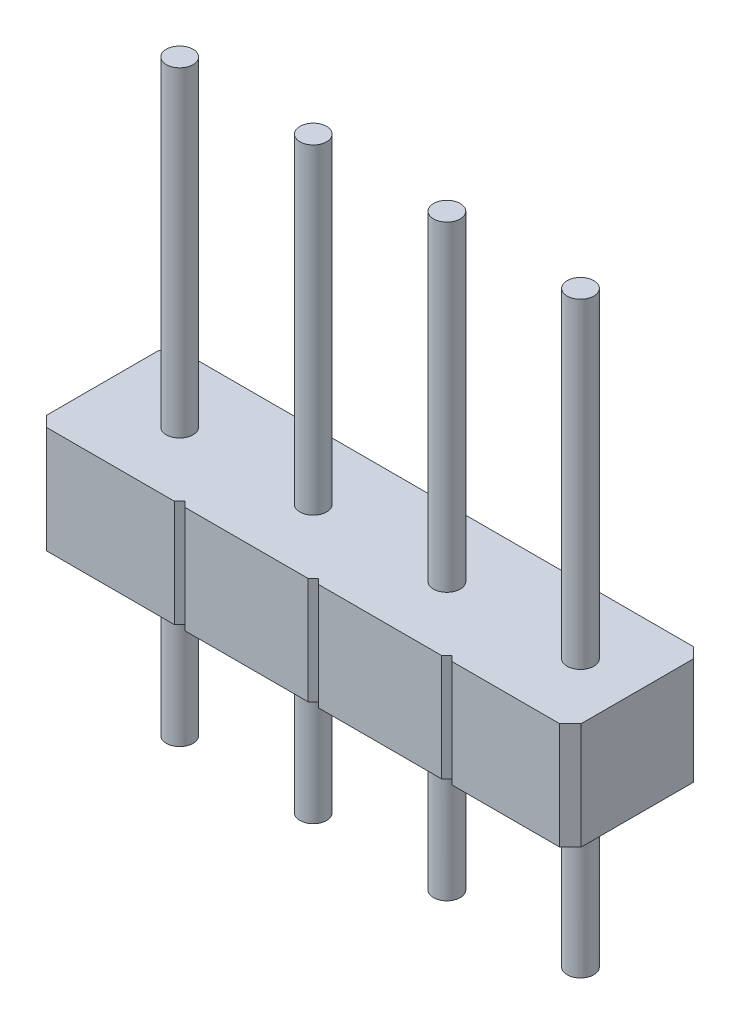
ISO-10303-21;
HEADER;
FILE_DESCRIPTION(('STEP AP214'),'2;1');
FILE_NAME('part.step','',(''),(''),'','','');
FILE_SCHEMA(('AUTOMOTIVE_DESIGN { 1 0 10303 214 1 1 1 1 }'));
ENDSEC;
DATA;
#1=APPLICATION_CONTEXT('core data for automotive mechanical design processes');
#2=APPLICATION_PROTOCOL_DEFINITION('international standard','automotive_design',2000,#1);
#3=PRODUCT_CONTEXT('',#1,'mechanical');
#4=PRODUCT('Part','Part','',(#3));
#5=PRODUCT_RELATED_PRODUCT_CATEGORY('part','',(#4));
#6=PRODUCT_DEFINITION_FORMATION('','',#4);
#7=PRODUCT_DEFINITION_CONTEXT('part definition',#1,'design');
#8=PRODUCT_DEFINITION('design','',#6,#7);
#9=PRODUCT_DEFINITION_SHAPE('','',#8);
#10=(LENGTH_UNIT() NAMED_UNIT(*) SI_UNIT(.MILLI.,.METRE.));
#11=(NAMED_UNIT(*) PLANE_ANGLE_UNIT() SI_UNIT($,.RADIAN.));
#12=(NAMED_UNIT(*) SI_UNIT($,.STERADIAN.) SOLID_ANGLE_UNIT());
#13=UNCERTAINTY_MEASURE_WITH_UNIT(LENGTH_MEASURE(1.E-05),#10,'distance_accuracy_value','');
#14=(GEOMETRIC_REPRESENTATION_CONTEXT(3) GLOBAL_UNCERTAINTY_ASSIGNED_CONTEXT((#13)) GLOBAL_UNIT_ASSIGNED_CONTEXT((#10,
#11,#12)) REPRESENTATION_CONTEXT('',''));
#15=CARTESIAN_POINT('',(0.,0.,0.));
#16=DIRECTION('',(0.,0.,1.));
#17=DIRECTION('',(1.,0.,0.));
#18=AXIS2_PLACEMENT_3D('',#15,#16,#17);
#19=CARTESIAN_POINT('',(0.,2.,0.));
#20=DIRECTION('',(0.,-1.,0.));
#21=DIRECTION('',(0.,0.,-1.));
#22=AXIS2_PLACEMENT_3D('',#19,#20,#21);
#23=PLANE('',#22);
#24=DIRECTION('',(-0.707106781186547,0.,0.707106781186548));
#25=VECTOR('',#24,1.);
#26=CARTESIAN_POINT('',(-5.,2.,-1.05));
#27=LINE('',#26,#25);
#28=CARTESIAN_POINT('',(-4.8,2.,-1.25));
#29=VERTEX_POINT('',#28);
#30=CARTESIAN_POINT('',(-5.,2.,-1.05));
#31=VERTEX_POINT('',#30);
#32=EDGE_CURVE('E291',#29,#31,#27,.T.);
#33=ORIENTED_EDGE('',*,*,#32,.T.);
#34=DIRECTION('',(0.,0.,1.));
#35=VECTOR('',#34,1.);
#36=CARTESIAN_POINT('',(-5.,2.,-1.05));
#37=LINE('',#36,#35);
#38=CARTESIAN_POINT('',(-5.,2.,1.05));
#39=VERTEX_POINT('',#38);
#40=EDGE_CURVE('E149',#31,#39,#37,.T.);
#41=ORIENTED_EDGE('',*,*,#40,.T.);
#42=DIRECTION('',(0.707106781186547,0.,0.707106781186548));
#43=VECTOR('',#42,1.);
#44=CARTESIAN_POINT('',(-5.,2.,1.05));
#45=LINE('',#44,#43);
#46=CARTESIAN_POINT('',(-4.8,2.,1.25));
#47=VERTEX_POINT('',#46);
#48=EDGE_CURVE('E360',#39,#47,#45,.T.);
#49=ORIENTED_EDGE('',*,*,#48,.T.);
#50=DIRECTION('',(1.,0.,0.));
#51=VECTOR('',#50,1.);
#52=CARTESIAN_POINT('',(-4.8,2.,1.25));
#53=LINE('',#52,#51);
#54=CARTESIAN_POINT('',(-2.41138997367375,2.,1.25));
#55=VERTEX_POINT('',#54);
#56=EDGE_CURVE('E379',#47,#55,#53,.T.);
#57=ORIENTED_EDGE('',*,*,#56,.T.);
#58=DIRECTION('',(0.707106781186545,0.,-0.70710678118655));
#59=VECTOR('',#58,1.);
#60=CARTESIAN_POINT('',(-2.41138997367375,2.,1.25));
#61=LINE('',#60,#59);
#62=CARTESIAN_POINT('',(-2.31138997367375,2.,1.15));
#63=VERTEX_POINT('',#62);
#64=EDGE_CURVE('E376',#55,#63,#61,.T.);
#65=ORIENTED_EDGE('',*,*,#64,.T.);
#66=DIRECTION('',(0.707106781186548,0.,0.707106781186547));
#67=VECTOR('',#66,1.);
#68=CARTESIAN_POINT('',(-2.31138997367375,2.,1.15));
#69=LINE('',#68,#67);
#70=CARTESIAN_POINT('',(-2.21138997367375,2.,1.25));
#71=VERTEX_POINT('',#70);
#72=EDGE_CURVE('E378',#63,#71,#69,.T.);
#73=ORIENTED_EDGE('',*,*,#72,.T.);
#74=DIRECTION('',(1.,0.,0.));
#75=VECTOR('',#74,1.);
#76=CARTESIAN_POINT('',(-2.21138997367375,2.,1.25));
#77=LINE('',#76,#75);
#78=CARTESIAN_POINT('',(0.0886100263262443,2.,1.25));
#79=VERTEX_POINT('',#78);
#80=EDGE_CURVE('E381',#71,#79,#77,.T.);
#81=ORIENTED_EDGE('',*,*,#80,.T.);
#82=DIRECTION('',(0.707106781186546,0.,-0.707106781186549));
#83=VECTOR('',#82,1.);
#84=CARTESIAN_POINT('',(0.0886100263262443,2.,1.25));
#85=LINE('',#84,#83);
#86=CARTESIAN_POINT('',(0.188610026326244,2.,1.15));
#87=VERTEX_POINT('',#86);
#88=EDGE_CURVE('E387',#79,#87,#85,.T.);
#89=ORIENTED_EDGE('',*,*,#88,.T.);
#90=DIRECTION('',(0.707106781186549,0.,0.707106781186546));
#91=VECTOR('',#90,1.);
#92=CARTESIAN_POINT('',(0.188610026326244,2.,1.15));
#93=LINE('',#92,#91);
#94=CARTESIAN_POINT('',(0.288610026326245,2.,1.25));
#95=VERTEX_POINT('',#94);
#96=EDGE_CURVE('E389',#87,#95,#93,.T.);
#97=ORIENTED_EDGE('',*,*,#96,.T.);
#98=DIRECTION('',(1.,0.,0.));
#99=VECTOR('',#98,1.);
#100=CARTESIAN_POINT('',(0.288610026326245,2.,1.25));
#101=LINE('',#100,#99);
#102=CARTESIAN_POINT('',(2.58861002632625,2.,1.25));
#103=VERTEX_POINT('',#102);
#104=EDGE_CURVE('E391',#95,#103,#101,.T.);
#105=ORIENTED_EDGE('',*,*,#104,.T.);
#106=DIRECTION('',(0.707106781186546,0.,-0.707106781186549));
#107=VECTOR('',#106,1.);
#108=CARTESIAN_POINT('',(2.58861002632625,2.,1.25));
#109=LINE('',#108,#107);
#110=CARTESIAN_POINT('',(2.68861002632624,2.,1.15));
#111=VERTEX_POINT('',#110);
#112=EDGE_CURVE('E393',#103,#111,#109,.T.);
#113=ORIENTED_EDGE('',*,*,#112,.T.);
#114=DIRECTION('',(0.707106781186549,0.,0.707106781186546));
#115=VECTOR('',#114,1.);
#116=CARTESIAN_POINT('',(2.68861002632624,2.,1.15));
#117=LINE('',#116,#115);
#118=CARTESIAN_POINT('',(2.78861002632624,2.,1.25));
#119=VERTEX_POINT('',#118);
#120=EDGE_CURVE('E395',#111,#119,#117,.T.);
#121=ORIENTED_EDGE('',*,*,#120,.T.);
#122=DIRECTION('',(1.,0.,0.));
#123=VECTOR('',#122,1.);
#124=CARTESIAN_POINT('',(2.78861002632624,2.,1.25));
#125=LINE('',#124,#123);
#126=CARTESIAN_POINT('',(4.8,2.,1.25));
#127=VERTEX_POINT('',#126);
#128=EDGE_CURVE('E397',#119,#127,#125,.T.);
#129=ORIENTED_EDGE('',*,*,#128,.T.);
#130=DIRECTION('',(0.707106781186547,0.,-0.707106781186548));
#131=VECTOR('',#130,1.);
#132=CARTESIAN_POINT('',(4.8,2.,1.25));
#133=LINE('',#132,#131);
#134=CARTESIAN_POINT('',(5.,2.,1.05));
#135=VERTEX_POINT('',#134);
#136=EDGE_CURVE('E399',#127,#135,#133,.T.);
#137=ORIENTED_EDGE('',*,*,#136,.T.);
#138=DIRECTION('',(0.,0.,-1.));
#139=VECTOR('',#138,1.);
#140=CARTESIAN_POINT('',(5.,2.,-1.05));
#141=LINE('',#140,#139);
#142=CARTESIAN_POINT('',(5.,2.,-1.05));
#143=VERTEX_POINT('',#142);
#144=EDGE_CURVE('E401',#135,#143,#141,.T.);
#145=ORIENTED_EDGE('',*,*,#144,.T.);
#146=DIRECTION('',(-0.707106781186547,0.,-0.707106781186548));
#147=VECTOR('',#146,1.);
#148=CARTESIAN_POINT('',(4.8,2.,-1.25));
#149=LINE('',#148,#147);
#150=CARTESIAN_POINT('',(4.8,2.,-1.25));
#151=VERTEX_POINT('',#150);
#152=EDGE_CURVE('E403',#143,#151,#149,.T.);
#153=ORIENTED_EDGE('',*,*,#152,.T.);
#154=DIRECTION('',(-1.,0.,0.));
#155=VECTOR('',#154,1.);
#156=CARTESIAN_POINT('',(2.78861002632624,2.,-1.25));
#157=LINE('',#156,#155);
#158=CARTESIAN_POINT('',(2.78861002632624,2.,-1.25));
#159=VERTEX_POINT('',#158);
#160=EDGE_CURVE('E405',#151,#159,#157,.T.);
#161=ORIENTED_EDGE('',*,*,#160,.T.);
#162=DIRECTION('',(-0.707106781186547,0.,0.707106781186548));
#163=VECTOR('',#162,1.);
#164=CARTESIAN_POINT('',(2.68861002632624,2.,-1.15));
#165=LINE('',#164,#163);
#166=CARTESIAN_POINT('',(2.68861002632624,2.,-1.15));
#167=VERTEX_POINT('',#166);
#168=EDGE_CURVE('E407',#159,#167,#165,.T.);
#169=ORIENTED_EDGE('',*,*,#168,.T.);
#170=DIRECTION('',(-0.707106781186547,0.,-0.707106781186548));
#171=VECTOR('',#170,1.);
#172=CARTESIAN_POINT('',(2.58861002632624,2.,-1.25));
#173=LINE('',#172,#171);
#174=CARTESIAN_POINT('',(2.58861002632624,2.,-1.25));
#175=VERTEX_POINT('',#174);
#176=EDGE_CURVE('E409',#167,#175,#173,.T.);
#177=ORIENTED_EDGE('',*,*,#176,.T.);
#178=DIRECTION('',(-1.,0.,0.));
#179=VECTOR('',#178,1.);
#180=CARTESIAN_POINT('',(0.288610026326243,2.,-1.25));
#181=LINE('',#180,#179);
#182=CARTESIAN_POINT('',(0.288610026326243,2.,-1.25));
#183=VERTEX_POINT('',#182);
#184=EDGE_CURVE('E411',#175,#183,#181,.T.);
#185=ORIENTED_EDGE('',*,*,#184,.T.);
#186=DIRECTION('',(-0.707106781186547,0.,0.707106781186549));
#187=VECTOR('',#186,1.);
#188=CARTESIAN_POINT('',(0.188610026326244,2.,-1.15));
#189=LINE('',#188,#187);
#190=CARTESIAN_POINT('',(0.188610026326244,2.,-1.15));
#191=VERTEX_POINT('',#190);
#192=EDGE_CURVE('E413',#183,#191,#189,.T.);
#193=ORIENTED_EDGE('',*,*,#192,.T.);
#194=DIRECTION('',(-0.707106781186549,0.,-0.707106781186546));
#195=VECTOR('',#194,1.);
#196=CARTESIAN_POINT('',(0.0886100263262439,2.,-1.25));
#197=LINE('',#196,#195);
#198=CARTESIAN_POINT('',(0.0886100263262439,2.,-1.25));
#199=VERTEX_POINT('',#198);
#200=EDGE_CURVE('E415',#191,#199,#197,.T.);
#201=ORIENTED_EDGE('',*,*,#200,.T.);
#202=DIRECTION('',(-1.,0.,0.));
#203=VECTOR('',#202,1.);
#204=CARTESIAN_POINT('',(-2.2107197566744,2.,-1.25));
#205=LINE('',#204,#203);
#206=CARTESIAN_POINT('',(-2.2107197566744,2.,-1.25));
#207=VERTEX_POINT('',#206);
#208=EDGE_CURVE('E222',#199,#207,#205,.T.);
#209=ORIENTED_EDGE('',*,*,#208,.T.);
#210=DIRECTION('',(-0.619239922198396,0.,0.785201833133191));
#211=VECTOR('',#210,1.);
#212=CARTESIAN_POINT('',(-2.31138997367376,2.,-1.12234925253336));
#213=LINE('',#212,#211);
#214=CARTESIAN_POINT('',(-2.31138997367376,2.,-1.12234925253336));
#215=VERTEX_POINT('',#214);
#216=EDGE_CURVE('E216',#207,#215,#213,.T.);
#217=ORIENTED_EDGE('',*,*,#216,.T.);
#218=DIRECTION('',(-0.619239922198393,0.,-0.785201833133194));
#219=VECTOR('',#218,1.);
#220=CARTESIAN_POINT('',(-2.41206019067311,2.,-1.25));
#221=LINE('',#220,#219);
#222=CARTESIAN_POINT('',(-2.41206019067311,2.,-1.25));
#223=VERTEX_POINT('',#222);
#224=EDGE_CURVE('E220',#215,#223,#221,.T.);
#225=ORIENTED_EDGE('',*,*,#224,.T.);
#226=DIRECTION('',(-1.,0.,0.));
#227=VECTOR('',#226,1.);
#228=CARTESIAN_POINT('',(-4.8,2.,-1.25));
#229=LINE('',#228,#227);
#230=EDGE_CURVE('E52',#223,#29,#229,.T.);
#231=ORIENTED_EDGE('',*,*,#230,.T.);
#232=EDGE_LOOP('',(#33,#41,#49,#57,#65,#73,#81,#89,#97,#105,#113,#121,#129,#137,#145,#153,#161,
#169,#177,#185,#193,#201,#209,#217,#225,#231));
#233=FACE_BOUND('',#232,.T.);
#234=CARTESIAN_POINT('',(-3.56138997367376,2.,0.));
#235=DIRECTION('',(0.,1.,0.));
#236=DIRECTION('',(0.,0.,1.));
#237=AXIS2_PLACEMENT_3D('',#234,#235,#236);
#238=CIRCLE('',#237,0.25);
#239=CARTESIAN_POINT('',(-3.56138997367376,2.,0.25));
#240=VERTEX_POINT('',#239);
#241=EDGE_CURVE('E244',#240,#240,#238,.T.);
#242=ORIENTED_EDGE('',*,*,#241,.F.);
#243=EDGE_LOOP('',(#242));
#244=FACE_BOUND('',#243,.T.);
#245=CARTESIAN_POINT('',(-1.06138997367376,2.,0.));
#246=DIRECTION('',(0.,1.,0.));
#247=DIRECTION('',(0.,0.,1.));
#248=AXIS2_PLACEMENT_3D('',#245,#246,#247);
#249=CIRCLE('',#248,0.25);
#250=CARTESIAN_POINT('',(-1.06138997367376,2.,0.25));
#251=VERTEX_POINT('',#250);
#252=EDGE_CURVE('E543',#251,#251,#249,.T.);
#253=ORIENTED_EDGE('',*,*,#252,.F.);
#254=EDGE_LOOP('',(#253));
#255=FACE_BOUND('',#254,.T.);
#256=CARTESIAN_POINT('',(1.43861002632624,2.,0.));
#257=DIRECTION('',(0.,1.,0.));
#258=DIRECTION('',(0.,0.,1.));
#259=AXIS2_PLACEMENT_3D('',#256,#257,#258);
#260=CIRCLE('',#259,0.25);
#261=CARTESIAN_POINT('',(1.43861002632624,2.,0.25));
#262=VERTEX_POINT('',#261);
#263=EDGE_CURVE('E540',#262,#262,#260,.T.);
#264=ORIENTED_EDGE('',*,*,#263,.F.);
#265=EDGE_LOOP('',(#264));
#266=FACE_BOUND('',#265,.T.);
#267=CARTESIAN_POINT('',(3.93861002632624,2.,0.));
#268=DIRECTION('',(0.,1.,0.));
#269=DIRECTION('',(0.,0.,1.));
#270=AXIS2_PLACEMENT_3D('',#267,#268,#269);
#271=CIRCLE('',#270,0.250000000000001);
#272=CARTESIAN_POINT('',(3.93861002632624,2.,0.250000000000001));
#273=VERTEX_POINT('',#272);
#274=EDGE_CURVE('E537',#273,#273,#271,.T.);
#275=ORIENTED_EDGE('',*,*,#274,.F.);
#276=EDGE_LOOP('',(#275));
#277=FACE_BOUND('',#276,.T.);
#278=ADVANCED_FACE('F35',(#233,#244,#255,#266,#277),#23,.F.);
#279=CARTESIAN_POINT('',(0.,0.,0.));
#280=DIRECTION('',(0.,-1.,0.));
#281=DIRECTION('',(0.,0.,-1.));
#282=AXIS2_PLACEMENT_3D('',#279,#280,#281);
#283=PLANE('',#282);
#284=CARTESIAN_POINT('',(1.43861002632624,0.,0.));
#285=DIRECTION('',(0.,-1.,0.));
#286=DIRECTION('',(0.,0.,-1.));
#287=AXIS2_PLACEMENT_3D('',#284,#285,#286);
#288=CIRCLE('',#287,0.25);
#289=CARTESIAN_POINT('',(1.43861002632624,0.,-0.25));
#290=VERTEX_POINT('',#289);
#291=EDGE_CURVE('E516',#290,#290,#288,.T.);
#292=ORIENTED_EDGE('',*,*,#291,.F.);
#293=EDGE_LOOP('',(#292));
#294=FACE_BOUND('',#293,.T.);
#295=CARTESIAN_POINT('',(-3.56138997367376,0.,0.));
#296=DIRECTION('',(0.,-1.,0.));
#297=DIRECTION('',(0.,0.,-1.));
#298=AXIS2_PLACEMENT_3D('',#295,#296,#297);
#299=CIRCLE('',#298,0.25);
#300=CARTESIAN_POINT('',(-3.56138997367376,0.,-0.25));
#301=VERTEX_POINT('',#300);
#302=EDGE_CURVE('E534',#301,#301,#299,.T.);
#303=ORIENTED_EDGE('',*,*,#302,.F.);
#304=EDGE_LOOP('',(#303));
#305=FACE_BOUND('',#304,.T.);
#306=DIRECTION('',(-0.707106781186547,0.,0.707106781186548));
#307=VECTOR('',#306,1.);
#308=CARTESIAN_POINT('',(-5.,0.,-1.05));
#309=LINE('',#308,#307);
#310=CARTESIAN_POINT('',(-4.8,0.,-1.25));
#311=VERTEX_POINT('',#310);
#312=CARTESIAN_POINT('',(-5.,0.,-1.05));
#313=VERTEX_POINT('',#312);
#314=EDGE_CURVE('E240',#311,#313,#309,.T.);
#315=ORIENTED_EDGE('',*,*,#314,.F.);
#316=DIRECTION('',(-1.,0.,0.));
#317=VECTOR('',#316,1.);
#318=CARTESIAN_POINT('',(-4.8,0.,-1.25));
#319=LINE('',#318,#317);
#320=CARTESIAN_POINT('',(-2.41206019067311,0.,-1.25));
#321=VERTEX_POINT('',#320);
#322=EDGE_CURVE('E141',#321,#311,#319,.T.);
#323=ORIENTED_EDGE('',*,*,#322,.F.);
#324=DIRECTION('',(-0.619239922198393,0.,-0.785201833133194));
#325=VECTOR('',#324,1.);
#326=CARTESIAN_POINT('',(-2.41206019067311,0.,-1.25));
#327=LINE('',#326,#325);
#328=CARTESIAN_POINT('',(-2.31138997367376,0.,-1.12234925253336));
#329=VERTEX_POINT('',#328);
#330=EDGE_CURVE('E135',#329,#321,#327,.T.);
#331=ORIENTED_EDGE('',*,*,#330,.F.);
#332=DIRECTION('',(-0.619239922198396,0.,0.785201833133191));
#333=VECTOR('',#332,1.);
#334=CARTESIAN_POINT('',(-2.31138997367376,0.,-1.12234925253336));
#335=LINE('',#334,#333);
#336=CARTESIAN_POINT('',(-2.2107197566744,0.,-1.25));
#337=VERTEX_POINT('',#336);
#338=EDGE_CURVE('E230',#337,#329,#335,.T.);
#339=ORIENTED_EDGE('',*,*,#338,.F.);
#340=DIRECTION('',(-1.,0.,0.));
#341=VECTOR('',#340,1.);
#342=CARTESIAN_POINT('',(-2.2107197566744,0.,-1.25));
#343=LINE('',#342,#341);
#344=CARTESIAN_POINT('',(0.0886100263262439,0.,-1.25));
#345=VERTEX_POINT('',#344);
#346=EDGE_CURVE('E286',#345,#337,#343,.T.);
#347=ORIENTED_EDGE('',*,*,#346,.F.);
#348=DIRECTION('',(-0.707106781186549,0.,-0.707106781186546));
#349=VECTOR('',#348,1.);
#350=CARTESIAN_POINT('',(0.0886100263262439,0.,-1.25));
#351=LINE('',#350,#349);
#352=CARTESIAN_POINT('',(0.188610026326244,0.,-1.15));
#353=VERTEX_POINT('',#352);
#354=EDGE_CURVE('E284',#353,#345,#351,.T.);
#355=ORIENTED_EDGE('',*,*,#354,.F.);
#356=DIRECTION('',(-0.707106781186547,0.,0.707106781186549));
#357=VECTOR('',#356,1.);
#358=CARTESIAN_POINT('',(0.188610026326244,0.,-1.15));
#359=LINE('',#358,#357);
#360=CARTESIAN_POINT('',(0.288610026326243,0.,-1.25));
#361=VERTEX_POINT('',#360);
#362=EDGE_CURVE('E282',#361,#353,#359,.T.);
#363=ORIENTED_EDGE('',*,*,#362,.F.);
#364=DIRECTION('',(-1.,0.,0.));
#365=VECTOR('',#364,1.);
#366=CARTESIAN_POINT('',(0.288610026326243,0.,-1.25));
#367=LINE('',#366,#365);
#368=CARTESIAN_POINT('',(2.58861002632624,0.,-1.25));
#369=VERTEX_POINT('',#368);
#370=EDGE_CURVE('E280',#369,#361,#367,.T.);
#371=ORIENTED_EDGE('',*,*,#370,.F.);
#372=DIRECTION('',(-0.707106781186547,0.,-0.707106781186548));
#373=VECTOR('',#372,1.);
#374=CARTESIAN_POINT('',(2.58861002632624,0.,-1.25));
#375=LINE('',#374,#373);
#376=CARTESIAN_POINT('',(2.68861002632624,0.,-1.15));
#377=VERTEX_POINT('',#376);
#378=EDGE_CURVE('E278',#377,#369,#375,.T.);
#379=ORIENTED_EDGE('',*,*,#378,.F.);
#380=DIRECTION('',(-0.707106781186547,0.,0.707106781186548));
#381=VECTOR('',#380,1.);
#382=CARTESIAN_POINT('',(2.68861002632624,0.,-1.15));
#383=LINE('',#382,#381);
#384=CARTESIAN_POINT('',(2.78861002632624,0.,-1.25));
#385=VERTEX_POINT('',#384);
#386=EDGE_CURVE('E276',#385,#377,#383,.T.);
#387=ORIENTED_EDGE('',*,*,#386,.F.);
#388=DIRECTION('',(-1.,0.,0.));
#389=VECTOR('',#388,1.);
#390=CARTESIAN_POINT('',(2.78861002632624,0.,-1.25));
#391=LINE('',#390,#389);
#392=CARTESIAN_POINT('',(4.8,0.,-1.25));
#393=VERTEX_POINT('',#392);
#394=EDGE_CURVE('E274',#393,#385,#391,.T.);
#395=ORIENTED_EDGE('',*,*,#394,.F.);
#396=DIRECTION('',(-0.707106781186547,0.,-0.707106781186548));
#397=VECTOR('',#396,1.);
#398=CARTESIAN_POINT('',(4.8,0.,-1.25));
#399=LINE('',#398,#397);
#400=CARTESIAN_POINT('',(5.,0.,-1.05));
#401=VERTEX_POINT('',#400);
#402=EDGE_CURVE('E272',#401,#393,#399,.T.);
#403=ORIENTED_EDGE('',*,*,#402,.F.);
#404=DIRECTION('',(0.,0.,-1.));
#405=VECTOR('',#404,1.);
#406=CARTESIAN_POINT('',(5.,0.,-1.05));
#407=LINE('',#406,#405);
#408=CARTESIAN_POINT('',(5.,0.,1.05));
#409=VERTEX_POINT('',#408);
#410=EDGE_CURVE('E270',#409,#401,#407,.T.);
#411=ORIENTED_EDGE('',*,*,#410,.F.);
#412=DIRECTION('',(0.707106781186547,0.,-0.707106781186548));
#413=VECTOR('',#412,1.);
#414=CARTESIAN_POINT('',(4.8,0.,1.25));
#415=LINE('',#414,#413);
#416=CARTESIAN_POINT('',(4.8,0.,1.25));
#417=VERTEX_POINT('',#416);
#418=EDGE_CURVE('E268',#417,#409,#415,.T.);
#419=ORIENTED_EDGE('',*,*,#418,.F.);
#420=DIRECTION('',(1.,0.,0.));
#421=VECTOR('',#420,1.);
#422=CARTESIAN_POINT('',(2.78861002632624,0.,1.25));
#423=LINE('',#422,#421);
#424=CARTESIAN_POINT('',(2.78861002632624,0.,1.25));
#425=VERTEX_POINT('',#424);
#426=EDGE_CURVE('E266',#425,#417,#423,.T.);
#427=ORIENTED_EDGE('',*,*,#426,.F.);
#428=DIRECTION('',(0.707106781186549,0.,0.707106781186546));
#429=VECTOR('',#428,1.);
#430=CARTESIAN_POINT('',(2.68861002632624,0.,1.15));
#431=LINE('',#430,#429);
#432=CARTESIAN_POINT('',(2.68861002632624,0.,1.15));
#433=VERTEX_POINT('',#432);
#434=EDGE_CURVE('E264',#433,#425,#431,.T.);
#435=ORIENTED_EDGE('',*,*,#434,.F.);
#436=DIRECTION('',(0.707106781186546,0.,-0.707106781186549));
#437=VECTOR('',#436,1.);
#438=CARTESIAN_POINT('',(2.58861002632625,0.,1.25));
#439=LINE('',#438,#437);
#440=CARTESIAN_POINT('',(2.58861002632625,0.,1.25));
#441=VERTEX_POINT('',#440);
#442=EDGE_CURVE('E262',#441,#433,#439,.T.);
#443=ORIENTED_EDGE('',*,*,#442,.F.);
#444=DIRECTION('',(1.,0.,0.));
#445=VECTOR('',#444,1.);
#446=CARTESIAN_POINT('',(0.288610026326245,0.,1.25));
#447=LINE('',#446,#445);
#448=CARTESIAN_POINT('',(0.288610026326245,0.,1.25));
#449=VERTEX_POINT('',#448);
#450=EDGE_CURVE('E260',#449,#441,#447,.T.);
#451=ORIENTED_EDGE('',*,*,#450,.F.);
#452=DIRECTION('',(0.707106781186549,0.,0.707106781186546));
#453=VECTOR('',#452,1.);
#454=CARTESIAN_POINT('',(0.188610026326244,0.,1.15));
#455=LINE('',#454,#453);
#456=CARTESIAN_POINT('',(0.188610026326244,0.,1.15));
#457=VERTEX_POINT('',#456);
#458=EDGE_CURVE('E258',#457,#449,#455,.T.);
#459=ORIENTED_EDGE('',*,*,#458,.F.);
#460=DIRECTION('',(0.707106781186546,0.,-0.707106781186549));
#461=VECTOR('',#460,1.);
#462=CARTESIAN_POINT('',(0.0886100263262443,0.,1.25));
#463=LINE('',#462,#461);
#464=CARTESIAN_POINT('',(0.0886100263262443,0.,1.25));
#465=VERTEX_POINT('',#464);
#466=EDGE_CURVE('E256',#465,#457,#463,.T.);
#467=ORIENTED_EDGE('',*,*,#466,.F.);
#468=DIRECTION('',(1.,0.,0.));
#469=VECTOR('',#468,1.);
#470=CARTESIAN_POINT('',(-2.21138997367375,0.,1.25));
#471=LINE('',#470,#469);
#472=CARTESIAN_POINT('',(-2.21138997367375,0.,1.25));
#473=VERTEX_POINT('',#472);
#474=EDGE_CURVE('E254',#473,#465,#471,.T.);
#475=ORIENTED_EDGE('',*,*,#474,.F.);
#476=DIRECTION('',(0.707106781186548,0.,0.707106781186547));
#477=VECTOR('',#476,1.);
#478=CARTESIAN_POINT('',(-2.31138997367375,0.,1.15));
#479=LINE('',#478,#477);
#480=CARTESIAN_POINT('',(-2.31138997367375,0.,1.15));
#481=VERTEX_POINT('',#480);
#482=EDGE_CURVE('E252',#481,#473,#479,.T.);
#483=ORIENTED_EDGE('',*,*,#482,.F.);
#484=DIRECTION('',(0.707106781186545,0.,-0.70710678118655));
#485=VECTOR('',#484,1.);
#486=CARTESIAN_POINT('',(-2.41138997367375,0.,1.25));
#487=LINE('',#486,#485);
#488=CARTESIAN_POINT('',(-2.41138997367375,0.,1.25));
#489=VERTEX_POINT('',#488);
#490=EDGE_CURVE('E250',#489,#481,#487,.T.);
#491=ORIENTED_EDGE('',*,*,#490,.F.);
#492=DIRECTION('',(1.,0.,0.));
#493=VECTOR('',#492,1.);
#494=CARTESIAN_POINT('',(-4.8,0.,1.25));
#495=LINE('',#494,#493);
#496=CARTESIAN_POINT('',(-4.8,0.,1.25));
#497=VERTEX_POINT('',#496);
#498=EDGE_CURVE('E248',#497,#489,#495,.T.);
#499=ORIENTED_EDGE('',*,*,#498,.F.);
#500=DIRECTION('',(0.707106781186547,0.,0.707106781186548));
#501=VECTOR('',#500,1.);
#502=CARTESIAN_POINT('',(-5.,0.,1.05));
#503=LINE('',#502,#501);
#504=CARTESIAN_POINT('',(-5.,0.,1.05));
#505=VERTEX_POINT('',#504);
#506=EDGE_CURVE('E246',#505,#497,#503,.T.);
#507=ORIENTED_EDGE('',*,*,#506,.F.);
#508=DIRECTION('',(0.,0.,1.));
#509=VECTOR('',#508,1.);
#510=CARTESIAN_POINT('',(-5.,0.,-1.05));
#511=LINE('',#510,#509);
#512=EDGE_CURVE('E243',#313,#505,#511,.T.);
#513=ORIENTED_EDGE('',*,*,#512,.F.);
#514=EDGE_LOOP('',(#315,#323,#331,#339,#347,#355,#363,#371,#379,#387,#395,#403,#411,#419,#427,
#435,#443,#451,#459,#467,#475,#483,#491,#499,#507,#513));
#515=FACE_BOUND('',#514,.T.);
#516=CARTESIAN_POINT('',(-1.06138997367376,0.,0.));
#517=DIRECTION('',(0.,-1.,0.));
#518=DIRECTION('',(0.,0.,-1.));
#519=AXIS2_PLACEMENT_3D('',#516,#517,#518);
#520=CIRCLE('',#519,0.25);
#521=CARTESIAN_POINT('',(-1.06138997367376,0.,-0.25));
#522=VERTEX_POINT('',#521);
#523=EDGE_CURVE('E525',#522,#522,#520,.T.);
#524=ORIENTED_EDGE('',*,*,#523,.F.);
#525=EDGE_LOOP('',(#524));
#526=FACE_BOUND('',#525,.T.);
#527=CARTESIAN_POINT('',(3.93861002632624,0.,0.));
#528=DIRECTION('',(0.,-1.,0.));
#529=DIRECTION('',(0.,0.,-1.));
#530=AXIS2_PLACEMENT_3D('',#527,#528,#529);
#531=CIRCLE('',#530,0.250000000000001);
#532=CARTESIAN_POINT('',(3.93861002632624,0.,-0.250000000000001));
#533=VERTEX_POINT('',#532);
#534=EDGE_CURVE('E505',#533,#533,#531,.T.);
#535=ORIENTED_EDGE('',*,*,#534,.F.);
#536=EDGE_LOOP('',(#535));
#537=FACE_BOUND('',#536,.T.);
#538=ADVANCED_FACE('F364',(#294,#305,#515,#526,#537),#283,.T.);
#539=CARTESIAN_POINT('',(-5.,2.,-1.05));
#540=DIRECTION('',(0.707106781186548,0.,0.707106781186547));
#541=DIRECTION('',(0.707106781186547,0.,-0.707106781186548));
#542=AXIS2_PLACEMENT_3D('',#539,#540,#541);
#543=PLANE('',#542);
#544=ORIENTED_EDGE('',*,*,#314,.T.);
#545=DIRECTION('',(0.,-1.,0.));
#546=VECTOR('',#545,1.);
#547=CARTESIAN_POINT('',(-5.,2.,-1.05));
#548=LINE('',#547,#546);
#549=EDGE_CURVE('E11',#31,#313,#548,.T.);
#550=ORIENTED_EDGE('',*,*,#549,.F.);
#551=ORIENTED_EDGE('',*,*,#32,.F.);
#552=DIRECTION('',(0.,-1.,0.));
#553=VECTOR('',#552,1.);
#554=CARTESIAN_POINT('',(-4.8,2.,-1.25));
#555=LINE('',#554,#553);
#556=EDGE_CURVE('E236',#29,#311,#555,.T.);
#557=ORIENTED_EDGE('',*,*,#556,.T.);
#558=EDGE_LOOP('',(#544,#550,#551,#557));
#559=FACE_BOUND('',#558,.T.);
#560=ADVANCED_FACE('F37',(#559),#543,.F.);
#561=CARTESIAN_POINT('',(-5.,2.,-1.05));
#562=DIRECTION('',(1.,0.,0.));
#563=DIRECTION('',(0.,0.,-1.));
#564=AXIS2_PLACEMENT_3D('',#561,#562,#563);
#565=PLANE('',#564);
#566=ORIENTED_EDGE('',*,*,#512,.T.);
#567=DIRECTION('',(0.,-1.,0.));
#568=VECTOR('',#567,1.);
#569=CARTESIAN_POINT('',(-5.,2.,1.05));
#570=LINE('',#569,#568);
#571=EDGE_CURVE('E44',#39,#505,#570,.T.);
#572=ORIENTED_EDGE('',*,*,#571,.F.);
#573=ORIENTED_EDGE('',*,*,#40,.F.);
#574=ORIENTED_EDGE('',*,*,#549,.T.);
#575=EDGE_LOOP('',(#566,#572,#573,#574));
#576=FACE_BOUND('',#575,.T.);
#577=ADVANCED_FACE('F845',(#576),#565,.F.);
#578=CARTESIAN_POINT('',(-5.,2.,1.05));
#579=DIRECTION('',(0.707106781186548,0.,-0.707106781186547));
#580=DIRECTION('',(-0.707106781186547,0.,-0.707106781186548));
#581=AXIS2_PLACEMENT_3D('',#578,#579,#580);
#582=PLANE('',#581);
#583=ORIENTED_EDGE('',*,*,#506,.T.);
#584=DIRECTION('',(0.,-1.,0.));
#585=VECTOR('',#584,1.);
#586=CARTESIAN_POINT('',(-4.8,2.,1.25));
#587=LINE('',#586,#585);
#588=EDGE_CURVE('E352',#47,#497,#587,.T.);
#589=ORIENTED_EDGE('',*,*,#588,.F.);
#590=ORIENTED_EDGE('',*,*,#48,.F.);
#591=ORIENTED_EDGE('',*,*,#571,.T.);
#592=EDGE_LOOP('',(#583,#589,#590,#591));
#593=FACE_BOUND('',#592,.T.);
#594=ADVANCED_FACE('F358',(#593),#582,.F.);
#595=CARTESIAN_POINT('',(-4.8,2.,1.25));
#596=DIRECTION('',(0.,0.,-1.));
#597=DIRECTION('',(-1.,0.,0.));
#598=AXIS2_PLACEMENT_3D('',#595,#596,#597);
#599=PLANE('',#598);
#600=ORIENTED_EDGE('',*,*,#498,.T.);
#601=DIRECTION('',(0.,-1.,0.));
#602=VECTOR('',#601,1.);
#603=CARTESIAN_POINT('',(-2.41138997367375,2.,1.25));
#604=LINE('',#603,#602);
#605=EDGE_CURVE('E349',#55,#489,#604,.T.);
#606=ORIENTED_EDGE('',*,*,#605,.F.);
#607=ORIENTED_EDGE('',*,*,#56,.F.);
#608=ORIENTED_EDGE('',*,*,#588,.T.);
#609=EDGE_LOOP('',(#600,#606,#607,#608));
#610=FACE_BOUND('',#609,.T.);
#611=ADVANCED_FACE('F370',(#610),#599,.F.);
#612=CARTESIAN_POINT('',(-2.41138997367375,2.,1.25));
#613=DIRECTION('',(-0.70710678118655,0.,-0.707106781186545));
#614=DIRECTION('',(-0.707106781186545,0.,0.70710678118655));
#615=AXIS2_PLACEMENT_3D('',#612,#613,#614);
#616=PLANE('',#615);
#617=ORIENTED_EDGE('',*,*,#490,.T.);
#618=DIRECTION('',(0.,-1.,0.));
#619=VECTOR('',#618,1.);
#620=CARTESIAN_POINT('',(-2.31138997367375,2.,1.15));
#621=LINE('',#620,#619);
#622=EDGE_CURVE('E346',#63,#481,#621,.T.);
#623=ORIENTED_EDGE('',*,*,#622,.F.);
#624=ORIENTED_EDGE('',*,*,#64,.F.);
#625=ORIENTED_EDGE('',*,*,#605,.T.);
#626=EDGE_LOOP('',(#617,#623,#624,#625));
#627=FACE_BOUND('',#626,.T.);
#628=ADVANCED_FACE('F374',(#627),#616,.F.);
#629=CARTESIAN_POINT('',(-2.31138997367375,2.,1.15));
#630=DIRECTION('',(0.707106781186547,0.,-0.707106781186548));
#631=DIRECTION('',(-0.707106781186548,0.,-0.707106781186547));
#632=AXIS2_PLACEMENT_3D('',#629,#630,#631);
#633=PLANE('',#632);
#634=ORIENTED_EDGE('',*,*,#482,.T.);
#635=DIRECTION('',(0.,-1.,0.));
#636=VECTOR('',#635,1.);
#637=CARTESIAN_POINT('',(-2.21138997367375,2.,1.25));
#638=LINE('',#637,#636);
#639=EDGE_CURVE('E343',#71,#473,#638,.T.);
#640=ORIENTED_EDGE('',*,*,#639,.F.);
#641=ORIENTED_EDGE('',*,*,#72,.F.);
#642=ORIENTED_EDGE('',*,*,#622,.T.);
#643=EDGE_LOOP('',(#634,#640,#641,#642));
#644=FACE_BOUND('',#643,.T.);
#645=ADVANCED_FACE('F814',(#644),#633,.F.);
#646=CARTESIAN_POINT('',(-2.21138997367375,2.,1.25));
#647=DIRECTION('',(0.,0.,-1.));
#648=DIRECTION('',(-1.,0.,0.));
#649=AXIS2_PLACEMENT_3D('',#646,#647,#648);
#650=PLANE('',#649);
#651=ORIENTED_EDGE('',*,*,#474,.T.);
#652=DIRECTION('',(0.,-1.,0.));
#653=VECTOR('',#652,1.);
#654=CARTESIAN_POINT('',(0.0886100263262443,2.,1.25));
#655=LINE('',#654,#653);
#656=EDGE_CURVE('E340',#79,#465,#655,.T.);
#657=ORIENTED_EDGE('',*,*,#656,.F.);
#658=ORIENTED_EDGE('',*,*,#80,.F.);
#659=ORIENTED_EDGE('',*,*,#639,.T.);
#660=EDGE_LOOP('',(#651,#657,#658,#659));
#661=FACE_BOUND('',#660,.T.);
#662=ADVANCED_FACE('F805',(#661),#650,.F.);
#663=CARTESIAN_POINT('',(0.0886100263262443,2.,1.25));
#664=DIRECTION('',(-0.707106781186549,0.,-0.707106781186546));
#665=DIRECTION('',(-0.707106781186546,0.,0.707106781186549));
#666=AXIS2_PLACEMENT_3D('',#663,#664,#665);
#667=PLANE('',#666);
#668=ORIENTED_EDGE('',*,*,#466,.T.);
#669=DIRECTION('',(0.,-1.,0.));
#670=VECTOR('',#669,1.);
#671=CARTESIAN_POINT('',(0.188610026326244,2.,1.15));
#672=LINE('',#671,#670);
#673=EDGE_CURVE('E337',#87,#457,#672,.T.);
#674=ORIENTED_EDGE('',*,*,#673,.F.);
#675=ORIENTED_EDGE('',*,*,#88,.F.);
#676=ORIENTED_EDGE('',*,*,#656,.T.);
#677=EDGE_LOOP('',(#668,#674,#675,#676));
#678=FACE_BOUND('',#677,.T.);
#679=ADVANCED_FACE('F796',(#678),#667,.F.);
#680=CARTESIAN_POINT('',(0.188610026326244,2.,1.15));
#681=DIRECTION('',(0.707106781186546,0.,-0.707106781186549));
#682=DIRECTION('',(-0.707106781186549,0.,-0.707106781186546));
#683=AXIS2_PLACEMENT_3D('',#680,#681,#682);
#684=PLANE('',#683);
#685=ORIENTED_EDGE('',*,*,#458,.T.);
#686=DIRECTION('',(0.,-1.,0.));
#687=VECTOR('',#686,1.);
#688=CARTESIAN_POINT('',(0.288610026326245,2.,1.25));
#689=LINE('',#688,#687);
#690=EDGE_CURVE('E334',#95,#449,#689,.T.);
#691=ORIENTED_EDGE('',*,*,#690,.F.);
#692=ORIENTED_EDGE('',*,*,#96,.F.);
#693=ORIENTED_EDGE('',*,*,#673,.T.);
#694=EDGE_LOOP('',(#685,#691,#692,#693));
#695=FACE_BOUND('',#694,.T.);
#696=ADVANCED_FACE('F787',(#695),#684,.F.);
#697=CARTESIAN_POINT('',(0.288610026326245,2.,1.25));
#698=DIRECTION('',(0.,0.,-1.));
#699=DIRECTION('',(-1.,0.,0.));
#700=AXIS2_PLACEMENT_3D('',#697,#698,#699);
#701=PLANE('',#700);
#702=ORIENTED_EDGE('',*,*,#450,.T.);
#703=DIRECTION('',(0.,-1.,0.));
#704=VECTOR('',#703,1.);
#705=CARTESIAN_POINT('',(2.58861002632625,2.,1.25));
#706=LINE('',#705,#704);
#707=EDGE_CURVE('E331',#103,#441,#706,.T.);
#708=ORIENTED_EDGE('',*,*,#707,.F.);
#709=ORIENTED_EDGE('',*,*,#104,.F.);
#710=ORIENTED_EDGE('',*,*,#690,.T.);
#711=EDGE_LOOP('',(#702,#708,#709,#710));
#712=FACE_BOUND('',#711,.T.);
#713=ADVANCED_FACE('F778',(#712),#701,.F.);
#714=CARTESIAN_POINT('',(2.58861002632625,2.,1.25));
#715=DIRECTION('',(-0.707106781186549,0.,-0.707106781186546));
#716=DIRECTION('',(-0.707106781186546,0.,0.707106781186549));
#717=AXIS2_PLACEMENT_3D('',#714,#715,#716);
#718=PLANE('',#717);
#719=ORIENTED_EDGE('',*,*,#442,.T.);
#720=DIRECTION('',(0.,-1.,0.));
#721=VECTOR('',#720,1.);
#722=CARTESIAN_POINT('',(2.68861002632624,2.,1.15));
#723=LINE('',#722,#721);
#724=EDGE_CURVE('E328',#111,#433,#723,.T.);
#725=ORIENTED_EDGE('',*,*,#724,.F.);
#726=ORIENTED_EDGE('',*,*,#112,.F.);
#727=ORIENTED_EDGE('',*,*,#707,.T.);
#728=EDGE_LOOP('',(#719,#725,#726,#727));
#729=FACE_BOUND('',#728,.T.);
#730=ADVANCED_FACE('F769',(#729),#718,.F.);
#731=CARTESIAN_POINT('',(2.68861002632624,2.,1.15));
#732=DIRECTION('',(0.707106781186546,0.,-0.707106781186549));
#733=DIRECTION('',(-0.707106781186549,0.,-0.707106781186546));
#734=AXIS2_PLACEMENT_3D('',#731,#732,#733);
#735=PLANE('',#734);
#736=ORIENTED_EDGE('',*,*,#434,.T.);
#737=DIRECTION('',(0.,-1.,0.));
#738=VECTOR('',#737,1.);
#739=CARTESIAN_POINT('',(2.78861002632624,2.,1.25));
#740=LINE('',#739,#738);
#741=EDGE_CURVE('E325',#119,#425,#740,.T.);
#742=ORIENTED_EDGE('',*,*,#741,.F.);
#743=ORIENTED_EDGE('',*,*,#120,.F.);
#744=ORIENTED_EDGE('',*,*,#724,.T.);
#745=EDGE_LOOP('',(#736,#742,#743,#744));
#746=FACE_BOUND('',#745,.T.);
#747=ADVANCED_FACE('F760',(#746),#735,.F.);
#748=CARTESIAN_POINT('',(2.78861002632624,2.,1.25));
#749=DIRECTION('',(0.,0.,-1.));
#750=DIRECTION('',(-1.,0.,0.));
#751=AXIS2_PLACEMENT_3D('',#748,#749,#750);
#752=PLANE('',#751);
#753=ORIENTED_EDGE('',*,*,#426,.T.);
#754=DIRECTION('',(0.,-1.,0.));
#755=VECTOR('',#754,1.);
#756=CARTESIAN_POINT('',(4.8,2.,1.25));
#757=LINE('',#756,#755);
#758=EDGE_CURVE('E322',#127,#417,#757,.T.);
#759=ORIENTED_EDGE('',*,*,#758,.F.);
#760=ORIENTED_EDGE('',*,*,#128,.F.);
#761=ORIENTED_EDGE('',*,*,#741,.T.);
#762=EDGE_LOOP('',(#753,#759,#760,#761));
#763=FACE_BOUND('',#762,.T.);
#764=ADVANCED_FACE('F751',(#763),#752,.F.);
#765=CARTESIAN_POINT('',(4.8,2.,1.25));
#766=DIRECTION('',(-0.707106781186548,0.,-0.707106781186547));
#767=DIRECTION('',(-0.707106781186547,0.,0.707106781186548));
#768=AXIS2_PLACEMENT_3D('',#765,#766,#767);
#769=PLANE('',#768);
#770=ORIENTED_EDGE('',*,*,#418,.T.);
#771=DIRECTION('',(0.,-1.,0.));
#772=VECTOR('',#771,1.);
#773=CARTESIAN_POINT('',(5.,2.,1.05));
#774=LINE('',#773,#772);
#775=EDGE_CURVE('E319',#135,#409,#774,.T.);
#776=ORIENTED_EDGE('',*,*,#775,.F.);
#777=ORIENTED_EDGE('',*,*,#136,.F.);
#778=ORIENTED_EDGE('',*,*,#758,.T.);
#779=EDGE_LOOP('',(#770,#776,#777,#778));
#780=FACE_BOUND('',#779,.T.);
#781=ADVANCED_FACE('F742',(#780),#769,.F.);
#782=CARTESIAN_POINT('',(5.,2.,-1.05));
#783=DIRECTION('',(-1.,0.,0.));
#784=DIRECTION('',(0.,0.,1.));
#785=AXIS2_PLACEMENT_3D('',#782,#783,#784);
#786=PLANE('',#785);
#787=ORIENTED_EDGE('',*,*,#410,.T.);
#788=DIRECTION('',(0.,-1.,0.));
#789=VECTOR('',#788,1.);
#790=CARTESIAN_POINT('',(5.,2.,-1.05));
#791=LINE('',#790,#789);
#792=EDGE_CURVE('E316',#143,#401,#791,.T.);
#793=ORIENTED_EDGE('',*,*,#792,.F.);
#794=ORIENTED_EDGE('',*,*,#144,.F.);
#795=ORIENTED_EDGE('',*,*,#775,.T.);
#796=EDGE_LOOP('',(#787,#793,#794,#795));
#797=FACE_BOUND('',#796,.T.);
#798=ADVANCED_FACE('F733',(#797),#786,.F.);
#799=CARTESIAN_POINT('',(4.8,2.,-1.25));
#800=DIRECTION('',(-0.707106781186548,0.,0.707106781186547));
#801=DIRECTION('',(0.707106781186547,0.,0.707106781186548));
#802=AXIS2_PLACEMENT_3D('',#799,#800,#801);
#803=PLANE('',#802);
#804=ORIENTED_EDGE('',*,*,#402,.T.);
#805=DIRECTION('',(0.,-1.,0.));
#806=VECTOR('',#805,1.);
#807=CARTESIAN_POINT('',(4.8,2.,-1.25));
#808=LINE('',#807,#806);
#809=EDGE_CURVE('E313',#151,#393,#808,.T.);
#810=ORIENTED_EDGE('',*,*,#809,.F.);
#811=ORIENTED_EDGE('',*,*,#152,.F.);
#812=ORIENTED_EDGE('',*,*,#792,.T.);
#813=EDGE_LOOP('',(#804,#810,#811,#812));
#814=FACE_BOUND('',#813,.T.);
#815=ADVANCED_FACE('F724',(#814),#803,.F.);
#816=CARTESIAN_POINT('',(2.78861002632624,2.,-1.25));
#817=DIRECTION('',(0.,0.,1.));
#818=DIRECTION('',(1.,0.,0.));
#819=AXIS2_PLACEMENT_3D('',#816,#817,#818);
#820=PLANE('',#819);
#821=ORIENTED_EDGE('',*,*,#394,.T.);
#822=DIRECTION('',(0.,-1.,0.));
#823=VECTOR('',#822,1.);
#824=CARTESIAN_POINT('',(2.78861002632624,2.,-1.25));
#825=LINE('',#824,#823);
#826=EDGE_CURVE('E310',#159,#385,#825,.T.);
#827=ORIENTED_EDGE('',*,*,#826,.F.);
#828=ORIENTED_EDGE('',*,*,#160,.F.);
#829=ORIENTED_EDGE('',*,*,#809,.T.);
#830=EDGE_LOOP('',(#821,#827,#828,#829));
#831=FACE_BOUND('',#830,.T.);
#832=ADVANCED_FACE('F715',(#831),#820,.F.);
#833=CARTESIAN_POINT('',(2.68861002632624,2.,-1.15));
#834=DIRECTION('',(0.707106781186548,0.,0.707106781186547));
#835=DIRECTION('',(0.707106781186547,0.,-0.707106781186548));
#836=AXIS2_PLACEMENT_3D('',#833,#834,#835);
#837=PLANE('',#836);
#838=ORIENTED_EDGE('',*,*,#386,.T.);
#839=DIRECTION('',(0.,-1.,0.));
#840=VECTOR('',#839,1.);
#841=CARTESIAN_POINT('',(2.68861002632624,2.,-1.15));
#842=LINE('',#841,#840);
#843=EDGE_CURVE('E307',#167,#377,#842,.T.);
#844=ORIENTED_EDGE('',*,*,#843,.F.);
#845=ORIENTED_EDGE('',*,*,#168,.F.);
#846=ORIENTED_EDGE('',*,*,#826,.T.);
#847=EDGE_LOOP('',(#838,#844,#845,#846));
#848=FACE_BOUND('',#847,.T.);
#849=ADVANCED_FACE('F706',(#848),#837,.F.);
#850=CARTESIAN_POINT('',(2.58861002632624,2.,-1.25));
#851=DIRECTION('',(-0.707106781186548,0.,0.707106781186547));
#852=DIRECTION('',(0.707106781186547,0.,0.707106781186548));
#853=AXIS2_PLACEMENT_3D('',#850,#851,#852);
#854=PLANE('',#853);
#855=ORIENTED_EDGE('',*,*,#378,.T.);
#856=DIRECTION('',(0.,-1.,0.));
#857=VECTOR('',#856,1.);
#858=CARTESIAN_POINT('',(2.58861002632624,2.,-1.25));
#859=LINE('',#858,#857);
#860=EDGE_CURVE('E304',#175,#369,#859,.T.);
#861=ORIENTED_EDGE('',*,*,#860,.F.);
#862=ORIENTED_EDGE('',*,*,#176,.F.);
#863=ORIENTED_EDGE('',*,*,#843,.T.);
#864=EDGE_LOOP('',(#855,#861,#862,#863));
#865=FACE_BOUND('',#864,.T.);
#866=ADVANCED_FACE('F697',(#865),#854,.F.);
#867=CARTESIAN_POINT('',(0.288610026326243,2.,-1.25));
#868=DIRECTION('',(0.,0.,1.));
#869=DIRECTION('',(1.,0.,0.));
#870=AXIS2_PLACEMENT_3D('',#867,#868,#869);
#871=PLANE('',#870);
#872=ORIENTED_EDGE('',*,*,#370,.T.);
#873=DIRECTION('',(0.,-1.,0.));
#874=VECTOR('',#873,1.);
#875=CARTESIAN_POINT('',(0.288610026326243,2.,-1.25));
#876=LINE('',#875,#874);
#877=EDGE_CURVE('E301',#183,#361,#876,.T.);
#878=ORIENTED_EDGE('',*,*,#877,.F.);
#879=ORIENTED_EDGE('',*,*,#184,.F.);
#880=ORIENTED_EDGE('',*,*,#860,.T.);
#881=EDGE_LOOP('',(#872,#878,#879,#880));
#882=FACE_BOUND('',#881,.T.);
#883=ADVANCED_FACE('F688',(#882),#871,.F.);
#884=CARTESIAN_POINT('',(0.188610026326244,2.,-1.15));
#885=DIRECTION('',(0.707106781186549,0.,0.707106781186547));
#886=DIRECTION('',(0.707106781186547,0.,-0.707106781186549));
#887=AXIS2_PLACEMENT_3D('',#884,#885,#886);
#888=PLANE('',#887);
#889=ORIENTED_EDGE('',*,*,#362,.T.);
#890=DIRECTION('',(0.,-1.,0.));
#891=VECTOR('',#890,1.);
#892=CARTESIAN_POINT('',(0.188610026326244,2.,-1.15));
#893=LINE('',#892,#891);
#894=EDGE_CURVE('E298',#191,#353,#893,.T.);
#895=ORIENTED_EDGE('',*,*,#894,.F.);
#896=ORIENTED_EDGE('',*,*,#192,.F.);
#897=ORIENTED_EDGE('',*,*,#877,.T.);
#898=EDGE_LOOP('',(#889,#895,#896,#897));
#899=FACE_BOUND('',#898,.T.);
#900=ADVANCED_FACE('F680',(#899),#888,.F.);
#901=CARTESIAN_POINT('',(0.0886100263262439,2.,-1.25));
#902=DIRECTION('',(-0.707106781186546,0.,0.707106781186549));
#903=DIRECTION('',(0.707106781186549,0.,0.707106781186546));
#904=AXIS2_PLACEMENT_3D('',#901,#902,#903);
#905=PLANE('',#904);
#906=ORIENTED_EDGE('',*,*,#354,.T.);
#907=DIRECTION('',(0.,-1.,0.));
#908=VECTOR('',#907,1.);
#909=CARTESIAN_POINT('',(0.0886100263262439,2.,-1.25));
#910=LINE('',#909,#908);
#911=EDGE_CURVE('E295',#199,#345,#910,.T.);
#912=ORIENTED_EDGE('',*,*,#911,.F.);
#913=ORIENTED_EDGE('',*,*,#200,.F.);
#914=ORIENTED_EDGE('',*,*,#894,.T.);
#915=EDGE_LOOP('',(#906,#912,#913,#914));
#916=FACE_BOUND('',#915,.T.);
#917=ADVANCED_FACE('F421',(#916),#905,.F.);
#918=CARTESIAN_POINT('',(-2.2107197566744,2.,-1.25));
#919=DIRECTION('',(0.,0.,1.));
#920=DIRECTION('',(1.,0.,0.));
#921=AXIS2_PLACEMENT_3D('',#918,#919,#920);
#922=PLANE('',#921);
#923=ORIENTED_EDGE('',*,*,#346,.T.);
#924=DIRECTION('',(0.,-1.,0.));
#925=VECTOR('',#924,1.);
#926=CARTESIAN_POINT('',(-2.2107197566744,2.,-1.25));
#927=LINE('',#926,#925);
#928=EDGE_CURVE('E231',#207,#337,#927,.T.);
#929=ORIENTED_EDGE('',*,*,#928,.F.);
#930=ORIENTED_EDGE('',*,*,#208,.F.);
#931=ORIENTED_EDGE('',*,*,#911,.T.);
#932=EDGE_LOOP('',(#923,#929,#930,#931));
#933=FACE_BOUND('',#932,.T.);
#934=ADVANCED_FACE('F425',(#933),#922,.F.);
#935=CARTESIAN_POINT('',(-2.31138997367376,2.,-1.12234925253336));
#936=DIRECTION('',(0.785201833133191,0.,0.619239922198397));
#937=DIRECTION('',(0.619239922198397,0.,-0.785201833133191));
#938=AXIS2_PLACEMENT_3D('',#935,#936,#937);
#939=PLANE('',#938);
#940=ORIENTED_EDGE('',*,*,#338,.T.);
#941=DIRECTION('',(0.,-1.,0.));
#942=VECTOR('',#941,1.);
#943=CARTESIAN_POINT('',(-2.31138997367376,2.,-1.12234925253336));
#944=LINE('',#943,#942);
#945=EDGE_CURVE('E227',#215,#329,#944,.T.);
#946=ORIENTED_EDGE('',*,*,#945,.F.);
#947=ORIENTED_EDGE('',*,*,#216,.F.);
#948=ORIENTED_EDGE('',*,*,#928,.T.);
#949=EDGE_LOOP('',(#940,#946,#947,#948));
#950=FACE_BOUND('',#949,.T.);
#951=ADVANCED_FACE('F228',(#950),#939,.F.);
#952=CARTESIAN_POINT('',(-2.41206019067311,2.,-1.25));
#953=DIRECTION('',(-0.785201833133194,0.,0.619239922198393));
#954=DIRECTION('',(0.619239922198393,0.,0.785201833133194));
#955=AXIS2_PLACEMENT_3D('',#952,#953,#954);
#956=PLANE('',#955);
#957=ORIENTED_EDGE('',*,*,#330,.T.);
#958=DIRECTION('',(0.,-1.,0.));
#959=VECTOR('',#958,1.);
#960=CARTESIAN_POINT('',(-2.41206019067311,2.,-1.25));
#961=LINE('',#960,#959);
#962=EDGE_CURVE('E232',#223,#321,#961,.T.);
#963=ORIENTED_EDGE('',*,*,#962,.F.);
#964=ORIENTED_EDGE('',*,*,#224,.F.);
#965=ORIENTED_EDGE('',*,*,#945,.T.);
#966=EDGE_LOOP('',(#957,#963,#964,#965));
#967=FACE_BOUND('',#966,.T.);
#968=ADVANCED_FACE('F234',(#967),#956,.F.);
#969=CARTESIAN_POINT('',(-4.8,2.,-1.25));
#970=DIRECTION('',(0.,0.,1.));
#971=DIRECTION('',(1.,0.,0.));
#972=AXIS2_PLACEMENT_3D('',#969,#970,#971);
#973=PLANE('',#972);
#974=ORIENTED_EDGE('',*,*,#322,.T.);
#975=ORIENTED_EDGE('',*,*,#556,.F.);
#976=ORIENTED_EDGE('',*,*,#230,.F.);
#977=ORIENTED_EDGE('',*,*,#962,.T.);
#978=EDGE_LOOP('',(#974,#975,#976,#977));
#979=FACE_BOUND('',#978,.T.);
#980=ADVANCED_FACE('F429',(#979),#973,.F.);
#981=CARTESIAN_POINT('',(-3.56138997367376,-3.,0.));
#982=DIRECTION('',(0.,1.,0.));
#983=DIRECTION('',(0.,0.,1.));
#984=AXIS2_PLACEMENT_3D('',#981,#982,#983);
#985=PLANE('',#984);
#986=CARTESIAN_POINT('',(-3.56138997367376,-3.,0.));
#987=DIRECTION('',(0.,1.,0.));
#988=DIRECTION('',(0.,0.,1.));
#989=AXIS2_PLACEMENT_3D('',#986,#987,#988);
#990=CIRCLE('',#989,0.25);
#991=CARTESIAN_POINT('',(-3.56138997367376,-3.,0.25));
#992=VERTEX_POINT('',#991);
#993=EDGE_CURVE('E531',#992,#992,#990,.T.);
#994=ORIENTED_EDGE('',*,*,#993,.F.);
#995=EDGE_LOOP('',(#994));
#996=FACE_BOUND('',#995,.T.);
#997=ADVANCED_FACE('F431',(#996),#985,.F.);
#998=CARTESIAN_POINT('',(-3.56138997367376,-3.,0.));
#999=DIRECTION('',(0.,1.,0.));
#1000=DIRECTION('',(0.,0.,1.));
#1001=AXIS2_PLACEMENT_3D('',#998,#999,#1000);
#1002=CYLINDRICAL_SURFACE('',#1001,0.25);
#1003=ORIENTED_EDGE('',*,*,#302,.T.);
#1004=EDGE_LOOP('',(#1003));
#1005=FACE_BOUND('',#1004,.T.);
#1006=ORIENTED_EDGE('',*,*,#993,.T.);
#1007=EDGE_LOOP('',(#1006));
#1008=FACE_BOUND('',#1007,.T.);
#1009=ADVANCED_FACE('F437',(#1005,#1008),#1002,.T.);
#1010=CARTESIAN_POINT('',(-3.56138997367376,8.,0.));
#1011=DIRECTION('',(0.,1.,0.));
#1012=DIRECTION('',(0.,0.,1.));
#1013=AXIS2_PLACEMENT_3D('',#1010,#1011,#1012);
#1014=CIRCLE('',#1013,0.25);
#1015=CARTESIAN_POINT('',(-3.56138997367376,8.,0.25));
#1016=VERTEX_POINT('',#1015);
#1017=EDGE_CURVE('E528',#1016,#1016,#1014,.T.);
#1018=ORIENTED_EDGE('',*,*,#1017,.F.);
#1019=EDGE_LOOP('',(#1018));
#1020=FACE_BOUND('',#1019,.T.);
#1021=ORIENTED_EDGE('',*,*,#241,.T.);
#1022=EDGE_LOOP('',(#1021));
#1023=FACE_BOUND('',#1022,.T.);
#1024=ADVANCED_FACE('F450',(#1020,#1023),#1002,.T.);
#1025=CARTESIAN_POINT('',(-3.56138997367376,8.,0.));
#1026=DIRECTION('',(0.,1.,0.));
#1027=DIRECTION('',(0.,0.,1.));
#1028=AXIS2_PLACEMENT_3D('',#1025,#1026,#1027);
#1029=PLANE('',#1028);
#1030=ORIENTED_EDGE('',*,*,#1017,.T.);
#1031=EDGE_LOOP('',(#1030));
#1032=FACE_BOUND('',#1031,.T.);
#1033=ADVANCED_FACE('F453',(#1032),#1029,.T.);
#1034=CARTESIAN_POINT('',(-1.06138997367376,-3.,0.));
#1035=DIRECTION('',(0.,1.,0.));
#1036=DIRECTION('',(0.,0.,1.));
#1037=AXIS2_PLACEMENT_3D('',#1034,#1035,#1036);
#1038=PLANE('',#1037);
#1039=CARTESIAN_POINT('',(-1.06138997367376,-3.,0.));
#1040=DIRECTION('',(0.,1.,0.));
#1041=DIRECTION('',(0.,0.,1.));
#1042=AXIS2_PLACEMENT_3D('',#1039,#1040,#1041);
#1043=CIRCLE('',#1042,0.25);
#1044=CARTESIAN_POINT('',(-1.06138997367376,-3.,0.25));
#1045=VERTEX_POINT('',#1044);
#1046=EDGE_CURVE('E522',#1045,#1045,#1043,.T.);
#1047=ORIENTED_EDGE('',*,*,#1046,.F.);
#1048=EDGE_LOOP('',(#1047));
#1049=FACE_BOUND('',#1048,.T.);
#1050=ADVANCED_FACE('F456',(#1049),#1038,.F.);
#1051=CARTESIAN_POINT('',(-1.06138997367376,-3.,0.));
#1052=DIRECTION('',(0.,1.,0.));
#1053=DIRECTION('',(0.,0.,1.));
#1054=AXIS2_PLACEMENT_3D('',#1051,#1052,#1053);
#1055=CYLINDRICAL_SURFACE('',#1054,0.25);
#1056=ORIENTED_EDGE('',*,*,#523,.T.);
#1057=EDGE_LOOP('',(#1056));
#1058=FACE_BOUND('',#1057,.T.);
#1059=ORIENTED_EDGE('',*,*,#1046,.T.);
#1060=EDGE_LOOP('',(#1059));
#1061=FACE_BOUND('',#1060,.T.);
#1062=ADVANCED_FACE('F458',(#1058,#1061),#1055,.T.);
#1063=CARTESIAN_POINT('',(-1.06138997367376,8.,0.));
#1064=DIRECTION('',(0.,1.,0.));
#1065=DIRECTION('',(0.,0.,1.));
#1066=AXIS2_PLACEMENT_3D('',#1063,#1064,#1065);
#1067=CIRCLE('',#1066,0.25);
#1068=CARTESIAN_POINT('',(-1.06138997367376,8.,0.25));
#1069=VERTEX_POINT('',#1068);
#1070=EDGE_CURVE('E519',#1069,#1069,#1067,.T.);
#1071=ORIENTED_EDGE('',*,*,#1070,.F.);
#1072=EDGE_LOOP('',(#1071));
#1073=FACE_BOUND('',#1072,.T.);
#1074=ORIENTED_EDGE('',*,*,#252,.T.);
#1075=EDGE_LOOP('',(#1074));
#1076=FACE_BOUND('',#1075,.T.);
#1077=ADVANCED_FACE('F461',(#1073,#1076),#1055,.T.);
#1078=CARTESIAN_POINT('',(-1.06138997367376,8.,0.));
#1079=DIRECTION('',(0.,1.,0.));
#1080=DIRECTION('',(0.,0.,1.));
#1081=AXIS2_PLACEMENT_3D('',#1078,#1079,#1080);
#1082=PLANE('',#1081);
#1083=ORIENTED_EDGE('',*,*,#1070,.T.);
#1084=EDGE_LOOP('',(#1083));
#1085=FACE_BOUND('',#1084,.T.);
#1086=ADVANCED_FACE('F466',(#1085),#1082,.T.);
#1087=CARTESIAN_POINT('',(1.43861002632624,-3.,0.));
#1088=DIRECTION('',(0.,1.,0.));
#1089=DIRECTION('',(0.,0.,1.));
#1090=AXIS2_PLACEMENT_3D('',#1087,#1088,#1089);
#1091=PLANE('',#1090);
#1092=CARTESIAN_POINT('',(1.43861002632624,-3.,0.));
#1093=DIRECTION('',(0.,1.,0.));
#1094=DIRECTION('',(0.,0.,1.));
#1095=AXIS2_PLACEMENT_3D('',#1092,#1093,#1094);
#1096=CIRCLE('',#1095,0.25);
#1097=CARTESIAN_POINT('',(1.43861002632624,-3.,0.25));
#1098=VERTEX_POINT('',#1097);
#1099=EDGE_CURVE('E513',#1098,#1098,#1096,.T.);
#1100=ORIENTED_EDGE('',*,*,#1099,.F.);
#1101=EDGE_LOOP('',(#1100));
#1102=FACE_BOUND('',#1101,.T.);
#1103=ADVANCED_FACE('F469',(#1102),#1091,.F.);
#1104=CARTESIAN_POINT('',(1.43861002632624,-3.,0.));
#1105=DIRECTION('',(0.,1.,0.));
#1106=DIRECTION('',(0.,0.,1.));
#1107=AXIS2_PLACEMENT_3D('',#1104,#1105,#1106);
#1108=CYLINDRICAL_SURFACE('',#1107,0.25);
#1109=ORIENTED_EDGE('',*,*,#291,.T.);
#1110=EDGE_LOOP('',(#1109));
#1111=FACE_BOUND('',#1110,.T.);
#1112=ORIENTED_EDGE('',*,*,#1099,.T.);
#1113=EDGE_LOOP('',(#1112));
#1114=FACE_BOUND('',#1113,.T.);
#1115=ADVANCED_FACE('F471',(#1111,#1114),#1108,.T.);
#1116=CARTESIAN_POINT('',(1.43861002632624,8.,0.));
#1117=DIRECTION('',(0.,1.,0.));
#1118=DIRECTION('',(0.,0.,1.));
#1119=AXIS2_PLACEMENT_3D('',#1116,#1117,#1118);
#1120=CIRCLE('',#1119,0.25);
#1121=CARTESIAN_POINT('',(1.43861002632624,8.,0.25));
#1122=VERTEX_POINT('',#1121);
#1123=EDGE_CURVE('E510',#1122,#1122,#1120,.T.);
#1124=ORIENTED_EDGE('',*,*,#1123,.F.);
#1125=EDGE_LOOP('',(#1124));
#1126=FACE_BOUND('',#1125,.T.);
#1127=ORIENTED_EDGE('',*,*,#263,.T.);
#1128=EDGE_LOOP('',(#1127));
#1129=FACE_BOUND('',#1128,.T.);
#1130=ADVANCED_FACE('F474',(#1126,#1129),#1108,.T.);
#1131=CARTESIAN_POINT('',(1.43861002632624,8.,0.));
#1132=DIRECTION('',(0.,1.,0.));
#1133=DIRECTION('',(0.,0.,1.));
#1134=AXIS2_PLACEMENT_3D('',#1131,#1132,#1133);
#1135=PLANE('',#1134);
#1136=ORIENTED_EDGE('',*,*,#1123,.T.);
#1137=EDGE_LOOP('',(#1136));
#1138=FACE_BOUND('',#1137,.T.);
#1139=ADVANCED_FACE('F479',(#1138),#1135,.T.);
#1140=CARTESIAN_POINT('',(3.93861002632624,-3.,0.));
#1141=DIRECTION('',(0.,1.,0.));
#1142=DIRECTION('',(0.,0.,1.));
#1143=AXIS2_PLACEMENT_3D('',#1140,#1141,#1142);
#1144=PLANE('',#1143);
#1145=CARTESIAN_POINT('',(3.93861002632624,-3.,0.));
#1146=DIRECTION('',(0.,1.,0.));
#1147=DIRECTION('',(0.,0.,1.));
#1148=AXIS2_PLACEMENT_3D('',#1145,#1146,#1147);
#1149=CIRCLE('',#1148,0.250000000000001);
#1150=CARTESIAN_POINT('',(3.93861002632624,-3.,0.250000000000001));
#1151=VERTEX_POINT('',#1150);
#1152=EDGE_CURVE('E502',#1151,#1151,#1149,.T.);
#1153=ORIENTED_EDGE('',*,*,#1152,.F.);
#1154=EDGE_LOOP('',(#1153));
#1155=FACE_BOUND('',#1154,.T.);
#1156=ADVANCED_FACE('F482',(#1155),#1144,.F.);
#1157=CARTESIAN_POINT('',(3.93861002632624,-3.,0.));
#1158=DIRECTION('',(0.,1.,0.));
#1159=DIRECTION('',(0.,0.,1.));
#1160=AXIS2_PLACEMENT_3D('',#1157,#1158,#1159);
#1161=CYLINDRICAL_SURFACE('',#1160,0.250000000000001);
#1162=ORIENTED_EDGE('',*,*,#534,.T.);
#1163=EDGE_LOOP('',(#1162));
#1164=FACE_BOUND('',#1163,.T.);
#1165=ORIENTED_EDGE('',*,*,#1152,.T.);
#1166=EDGE_LOOP('',(#1165));
#1167=FACE_BOUND('',#1166,.T.);
#1168=ADVANCED_FACE('F484',(#1164,#1167),#1161,.T.);
#1169=CARTESIAN_POINT('',(3.93861002632624,8.,0.));
#1170=DIRECTION('',(0.,1.,0.));
#1171=DIRECTION('',(0.,0.,1.));
#1172=AXIS2_PLACEMENT_3D('',#1169,#1170,#1171);
#1173=CIRCLE('',#1172,0.250000000000001);
#1174=CARTESIAN_POINT('',(3.93861002632624,8.,0.250000000000001));
#1175=VERTEX_POINT('',#1174);
#1176=EDGE_CURVE('E501',#1175,#1175,#1173,.T.);
#1177=ORIENTED_EDGE('',*,*,#1176,.F.);
#1178=EDGE_LOOP('',(#1177));
#1179=FACE_BOUND('',#1178,.T.);
#1180=ORIENTED_EDGE('',*,*,#274,.T.);
#1181=EDGE_LOOP('',(#1180));
#1182=FACE_BOUND('',#1181,.T.);
#1183=ADVANCED_FACE('F487',(#1179,#1182),#1161,.T.);
#1184=CARTESIAN_POINT('',(3.93861002632624,8.,0.));
#1185=DIRECTION('',(0.,1.,0.));
#1186=DIRECTION('',(0.,0.,1.));
#1187=AXIS2_PLACEMENT_3D('',#1184,#1185,#1186);
#1188=PLANE('',#1187);
#1189=ORIENTED_EDGE('',*,*,#1176,.T.);
#1190=EDGE_LOOP('',(#1189));
#1191=FACE_BOUND('',#1190,.T.);
#1192=ADVANCED_FACE('F492',(#1191),#1188,.T.);
#1193=CLOSED_SHELL('',(#278,#538,#560,#577,#594,#611,#628,#645,#662,#679,#696,#713,#730,#747,
#764,#781,#798,#815,#832,#849,#866,#883,#900,#917,#934,#951,#968,#980,#997,#1009,#1024,#1033,
#1050,#1062,#1077,#1086,#1103,#1115,#1130,#1139,#1156,#1168,#1183,#1192));
#1194=MANIFOLD_SOLID_BREP('B2',#1193);
#1195=ADVANCED_BREP_SHAPE_REPRESENTATION('',(#18,#1194),#14);
#1196=SHAPE_DEFINITION_REPRESENTATION(#9,#1195);
ENDSEC;
END-ISO-10303-21;
